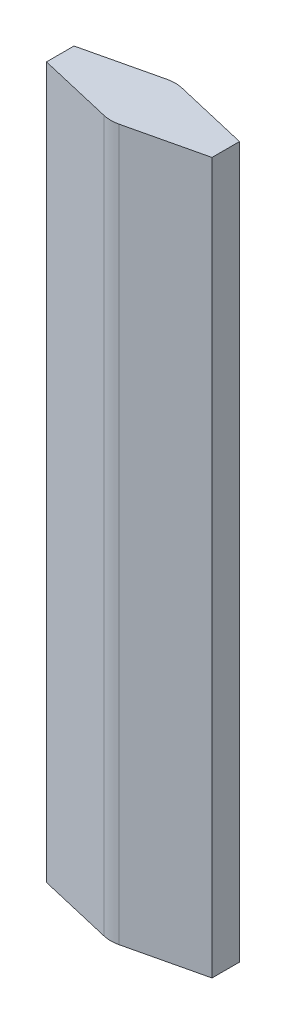
ISO-10303-21;
HEADER;
FILE_DESCRIPTION(('STEP AP214'),'2;1');
FILE_NAME('part.step','',(''),(''),'','','');
FILE_SCHEMA(('AUTOMOTIVE_DESIGN { 1 0 10303 214 1 1 1 1 }'));
ENDSEC;
DATA;
#1=APPLICATION_CONTEXT('core data for automotive mechanical design processes');
#2=APPLICATION_PROTOCOL_DEFINITION('international standard','automotive_design',2000,#1);
#3=PRODUCT_CONTEXT('',#1,'mechanical');
#4=PRODUCT('Part','Part','',(#3));
#5=PRODUCT_RELATED_PRODUCT_CATEGORY('part','',(#4));
#6=PRODUCT_DEFINITION_FORMATION('','',#4);
#7=PRODUCT_DEFINITION_CONTEXT('part definition',#1,'design');
#8=PRODUCT_DEFINITION('design','',#6,#7);
#9=PRODUCT_DEFINITION_SHAPE('','',#8);
#10=(LENGTH_UNIT() NAMED_UNIT(*) SI_UNIT(.MILLI.,.METRE.));
#11=(NAMED_UNIT(*) PLANE_ANGLE_UNIT() SI_UNIT($,.RADIAN.));
#12=(NAMED_UNIT(*) SI_UNIT($,.STERADIAN.) SOLID_ANGLE_UNIT());
#13=UNCERTAINTY_MEASURE_WITH_UNIT(LENGTH_MEASURE(1.E-05),#10,'distance_accuracy_value','');
#14=(GEOMETRIC_REPRESENTATION_CONTEXT(3) GLOBAL_UNCERTAINTY_ASSIGNED_CONTEXT((#13)) GLOBAL_UNIT_ASSIGNED_CONTEXT((#10,
#11,#12)) REPRESENTATION_CONTEXT('',''));
#15=CARTESIAN_POINT('',(0.,0.,0.));
#16=DIRECTION('',(0.,0.,1.));
#17=DIRECTION('',(1.,0.,0.));
#18=AXIS2_PLACEMENT_3D('',#15,#16,#17);
#19=CARTESIAN_POINT('',(0.,1500.,0.));
#20=DIRECTION('',(0.,-1.,0.));
#21=DIRECTION('',(0.,0.,-1.));
#22=AXIS2_PLACEMENT_3D('',#19,#20,#21);
#23=CYLINDRICAL_SURFACE('',#22,69.);
#24=CARTESIAN_POINT('',(0.,-10.,0.));
#25=DIRECTION('',(0.,1.,0.));
#26=DIRECTION('',(0.,0.,1.));
#27=AXIS2_PLACEMENT_3D('',#24,#25,#26);
#28=CIRCLE('',#27,69.);
#29=CARTESIAN_POINT('',(15.732,-10.,-67.1826181091508));
#30=VERTEX_POINT('',#29);
#31=CARTESIAN_POINT('',(-15.732,-10.,-67.1826181091508));
#32=VERTEX_POINT('',#31);
#33=EDGE_CURVE('E195',#30,#32,#28,.T.);
#34=ORIENTED_EDGE('',*,*,#33,.T.);
#35=DIRECTION('',(0.,1.,0.));
#36=VECTOR('',#35,1.);
#37=CARTESIAN_POINT('',(-15.732,1500.,-67.1826181091508));
#38=LINE('',#37,#36);
#39=CARTESIAN_POINT('',(-15.732,1510.,-67.1826181091508));
#40=VERTEX_POINT('',#39);
#41=EDGE_CURVE('E188',#40,#32,#38,.F.);
#42=ORIENTED_EDGE('',*,*,#41,.F.);
#43=CARTESIAN_POINT('',(0.,1510.,0.));
#44=DIRECTION('',(0.,1.,0.));
#45=DIRECTION('',(0.,0.,1.));
#46=AXIS2_PLACEMENT_3D('',#43,#44,#45);
#47=CIRCLE('',#46,69.);
#48=CARTESIAN_POINT('',(15.732,1510.,-67.1826181091508));
#49=VERTEX_POINT('',#48);
#50=EDGE_CURVE('E254',#49,#40,#47,.T.);
#51=ORIENTED_EDGE('',*,*,#50,.F.);
#52=DIRECTION('',(0.,-1.,0.));
#53=VECTOR('',#52,1.);
#54=CARTESIAN_POINT('',(15.732,1500.,-67.1826181091508));
#55=LINE('',#54,#53);
#56=EDGE_CURVE('E249',#49,#30,#55,.T.);
#57=ORIENTED_EDGE('',*,*,#56,.T.);
#58=EDGE_LOOP('',(#34,#42,#51,#57));
#59=FACE_BOUND('',#58,.T.);
#60=ADVANCED_FACE('F40',(#59),#23,.T.);
#61=CARTESIAN_POINT('',(-15.732,1500.,-67.1826181091508));
#62=DIRECTION('',(0.228,0.,0.973661132016679));
#63=DIRECTION('',(0.973661132016679,0.,-0.228));
#64=AXIS2_PLACEMENT_3D('',#61,#62,#63);
#65=PLANE('',#64);
#66=DIRECTION('',(-0.973661132016679,0.,0.228));
#67=VECTOR('',#66,1.);
#68=CARTESIAN_POINT('',(-15.732,-10.,-67.1826181091508));
#69=LINE('',#68,#67);
#70=CARTESIAN_POINT('',(-177.,-10.,-29.4188594554161));
#71=VERTEX_POINT('',#70);
#72=EDGE_CURVE('E182',#32,#71,#69,.T.);
#73=ORIENTED_EDGE('',*,*,#72,.T.);
#74=DIRECTION('',(0.,-1.,0.));
#75=VECTOR('',#74,1.);
#76=CARTESIAN_POINT('',(-177.,1500.,-29.4188594554161));
#77=LINE('',#76,#75);
#78=CARTESIAN_POINT('',(-177.,1510.,-29.4188594554161));
#79=VERTEX_POINT('',#78);
#80=EDGE_CURVE('E185',#79,#71,#77,.T.);
#81=ORIENTED_EDGE('',*,*,#80,.F.);
#82=DIRECTION('',(-0.973661132016679,0.,0.228));
#83=VECTOR('',#82,1.);
#84=CARTESIAN_POINT('',(-15.732,1510.,-67.1826181091508));
#85=LINE('',#84,#83);
#86=EDGE_CURVE('E216',#40,#79,#85,.T.);
#87=ORIENTED_EDGE('',*,*,#86,.F.);
#88=ORIENTED_EDGE('',*,*,#41,.T.);
#89=EDGE_LOOP('',(#73,#81,#87,#88));
#90=FACE_BOUND('',#89,.T.);
#91=ADVANCED_FACE('F184',(#90),#65,.F.);
#92=CARTESIAN_POINT('',(-177.,1500.,-21.4900228754757));
#93=DIRECTION('',(1.,0.,0.));
#94=DIRECTION('',(0.,0.,-1.));
#95=AXIS2_PLACEMENT_3D('',#92,#93,#94);
#96=PLANE('',#95);
#97=DIRECTION('',(0.,0.,1.));
#98=VECTOR('',#97,1.);
#99=CARTESIAN_POINT('',(-177.,-10.,-21.4900228754757));
#100=LINE('',#99,#98);
#101=CARTESIAN_POINT('',(-177.,-10.,29.4188594554161));
#102=VERTEX_POINT('',#101);
#103=EDGE_CURVE('E194',#71,#102,#100,.T.);
#104=ORIENTED_EDGE('',*,*,#103,.T.);
#105=DIRECTION('',(0.,-1.,0.));
#106=VECTOR('',#105,1.);
#107=CARTESIAN_POINT('',(-177.,1500.,29.4188594554161));
#108=LINE('',#107,#106);
#109=CARTESIAN_POINT('',(-177.,1510.,29.4188594554161));
#110=VERTEX_POINT('',#109);
#111=EDGE_CURVE('E203',#110,#102,#108,.T.);
#112=ORIENTED_EDGE('',*,*,#111,.F.);
#113=DIRECTION('',(0.,0.,1.));
#114=VECTOR('',#113,1.);
#115=CARTESIAN_POINT('',(-177.,1510.,-21.4900228754757));
#116=LINE('',#115,#114);
#117=EDGE_CURVE('E201',#79,#110,#116,.T.);
#118=ORIENTED_EDGE('',*,*,#117,.F.);
#119=ORIENTED_EDGE('',*,*,#80,.T.);
#120=EDGE_LOOP('',(#104,#112,#118,#119));
#121=FACE_BOUND('',#120,.T.);
#122=ADVANCED_FACE('F198',(#121),#96,.F.);
#123=CARTESIAN_POINT('',(-169.28,1500.,31.2266341956425));
#124=DIRECTION('',(0.228,0.,-0.973661132016679));
#125=DIRECTION('',(-0.973661132016679,0.,-0.228));
#126=AXIS2_PLACEMENT_3D('',#123,#124,#125);
#127=PLANE('',#126);
#128=DIRECTION('',(0.973661132016679,0.,0.228));
#129=VECTOR('',#128,1.);
#130=CARTESIAN_POINT('',(-169.28,-10.,31.2266341956425));
#131=LINE('',#130,#129);
#132=CARTESIAN_POINT('',(-15.7319998104866,-10.,67.1826181535287));
#133=VERTEX_POINT('',#132);
#134=EDGE_CURVE('E208',#102,#133,#131,.T.);
#135=ORIENTED_EDGE('',*,*,#134,.T.);
#136=DIRECTION('',(0.,-1.,0.));
#137=VECTOR('',#136,1.);
#138=CARTESIAN_POINT('',(-15.7319998104866,1500.,67.1826181535287));
#139=LINE('',#138,#137);
#140=CARTESIAN_POINT('',(-15.7319998104866,1510.,67.1826181535287));
#141=VERTEX_POINT('',#140);
#142=EDGE_CURVE('E219',#141,#133,#139,.T.);
#143=ORIENTED_EDGE('',*,*,#142,.F.);
#144=DIRECTION('',(0.973661132016679,0.,0.228));
#145=VECTOR('',#144,1.);
#146=CARTESIAN_POINT('',(-169.28,1510.,31.2266341956425));
#147=LINE('',#146,#145);
#148=EDGE_CURVE('E221',#110,#141,#147,.T.);
#149=ORIENTED_EDGE('',*,*,#148,.F.);
#150=ORIENTED_EDGE('',*,*,#111,.T.);
#151=EDGE_LOOP('',(#135,#143,#149,#150));
#152=FACE_BOUND('',#151,.T.);
#153=ADVANCED_FACE('F349',(#152),#127,.F.);
#154=CARTESIAN_POINT('',(0.,1500.,0.));
#155=DIRECTION('',(0.,-1.,0.));
#156=DIRECTION('',(0.,0.,-1.));
#157=AXIS2_PLACEMENT_3D('',#154,#155,#156);
#158=CYLINDRICAL_SURFACE('',#157,69.);
#159=CARTESIAN_POINT('',(0.,-10.,0.));
#160=DIRECTION('',(0.,1.,0.));
#161=DIRECTION('',(0.,0.,1.));
#162=AXIS2_PLACEMENT_3D('',#159,#160,#161);
#163=CIRCLE('',#162,69.);
#164=CARTESIAN_POINT('',(15.732,-10.,67.1826181091508));
#165=VERTEX_POINT('',#164);
#166=EDGE_CURVE('E212',#133,#165,#163,.T.);
#167=ORIENTED_EDGE('',*,*,#166,.T.);
#168=DIRECTION('',(0.,1.,0.));
#169=VECTOR('',#168,1.);
#170=CARTESIAN_POINT('',(15.732,1500.,67.1826181091508));
#171=LINE('',#170,#169);
#172=CARTESIAN_POINT('',(15.732,1510.,67.1826181091508));
#173=VERTEX_POINT('',#172);
#174=EDGE_CURVE('E226',#173,#165,#171,.F.);
#175=ORIENTED_EDGE('',*,*,#174,.F.);
#176=CARTESIAN_POINT('',(0.,1510.,0.));
#177=DIRECTION('',(0.,1.,0.));
#178=DIRECTION('',(0.,0.,1.));
#179=AXIS2_PLACEMENT_3D('',#176,#177,#178);
#180=CIRCLE('',#179,69.);
#181=EDGE_CURVE('E229',#141,#173,#180,.T.);
#182=ORIENTED_EDGE('',*,*,#181,.F.);
#183=ORIENTED_EDGE('',*,*,#142,.T.);
#184=EDGE_LOOP('',(#167,#175,#182,#183));
#185=FACE_BOUND('',#184,.T.);
#186=ADVANCED_FACE('F341',(#185),#158,.T.);
#187=CARTESIAN_POINT('',(15.732,1500.,67.1826181091508));
#188=DIRECTION('',(-0.228,0.,-0.973661132016679));
#189=DIRECTION('',(-0.973661132016679,0.,0.228));
#190=AXIS2_PLACEMENT_3D('',#187,#188,#189);
#191=PLANE('',#190);
#192=DIRECTION('',(0.973661132016679,0.,-0.228));
#193=VECTOR('',#192,1.);
#194=CARTESIAN_POINT('',(15.732,-10.,67.1826181091508));
#195=LINE('',#194,#193);
#196=CARTESIAN_POINT('',(177.,-10.,29.4188594554161));
#197=VERTEX_POINT('',#196);
#198=EDGE_CURVE('E154',#165,#197,#195,.T.);
#199=ORIENTED_EDGE('',*,*,#198,.T.);
#200=DIRECTION('',(0.,-1.,0.));
#201=VECTOR('',#200,1.);
#202=CARTESIAN_POINT('',(177.,1500.,29.4188594554161));
#203=LINE('',#202,#201);
#204=CARTESIAN_POINT('',(177.,1510.,29.4188594554161));
#205=VERTEX_POINT('',#204);
#206=EDGE_CURVE('E234',#205,#197,#203,.T.);
#207=ORIENTED_EDGE('',*,*,#206,.F.);
#208=DIRECTION('',(0.973661132016679,0.,-0.228));
#209=VECTOR('',#208,1.);
#210=CARTESIAN_POINT('',(15.732,1510.,67.1826181091508));
#211=LINE('',#210,#209);
#212=EDGE_CURVE('E237',#173,#205,#211,.T.);
#213=ORIENTED_EDGE('',*,*,#212,.F.);
#214=ORIENTED_EDGE('',*,*,#174,.T.);
#215=EDGE_LOOP('',(#199,#207,#213,#214));
#216=FACE_BOUND('',#215,.T.);
#217=ADVANCED_FACE('F345',(#216),#191,.F.);
#218=CARTESIAN_POINT('',(177.,1500.,21.4900228754757));
#219=DIRECTION('',(-1.,0.,0.));
#220=DIRECTION('',(0.,0.,1.));
#221=AXIS2_PLACEMENT_3D('',#218,#219,#220);
#222=PLANE('',#221);
#223=DIRECTION('',(0.,0.,-1.));
#224=VECTOR('',#223,1.);
#225=CARTESIAN_POINT('',(177.,-10.,21.4900228754757));
#226=LINE('',#225,#224);
#227=CARTESIAN_POINT('',(177.,-10.,-29.4188594554161));
#228=VERTEX_POINT('',#227);
#229=EDGE_CURVE('E146',#197,#228,#226,.T.);
#230=ORIENTED_EDGE('',*,*,#229,.T.);
#231=DIRECTION('',(0.,-1.,0.));
#232=VECTOR('',#231,1.);
#233=CARTESIAN_POINT('',(177.,1500.,-29.4188594554161));
#234=LINE('',#233,#232);
#235=CARTESIAN_POINT('',(177.,1510.,-29.4188594554161));
#236=VERTEX_POINT('',#235);
#237=EDGE_CURVE('E242',#236,#228,#234,.T.);
#238=ORIENTED_EDGE('',*,*,#237,.F.);
#239=DIRECTION('',(0.,0.,-1.));
#240=VECTOR('',#239,1.);
#241=CARTESIAN_POINT('',(177.,1510.,21.4900228754757));
#242=LINE('',#241,#240);
#243=EDGE_CURVE('E124',#205,#236,#242,.T.);
#244=ORIENTED_EDGE('',*,*,#243,.F.);
#245=ORIENTED_EDGE('',*,*,#206,.T.);
#246=EDGE_LOOP('',(#230,#238,#244,#245));
#247=FACE_BOUND('',#246,.T.);
#248=ADVANCED_FACE('F389',(#247),#222,.F.);
#249=CARTESIAN_POINT('',(169.28,1500.,-31.2266341956425));
#250=DIRECTION('',(-0.228,0.,0.973661132016679));
#251=DIRECTION('',(0.973661132016679,0.,0.228));
#252=AXIS2_PLACEMENT_3D('',#249,#250,#251);
#253=PLANE('',#252);
#254=DIRECTION('',(-0.973661132016679,0.,-0.228));
#255=VECTOR('',#254,1.);
#256=CARTESIAN_POINT('',(169.28,-10.,-31.2266341956425));
#257=LINE('',#256,#255);
#258=EDGE_CURVE('E136',#228,#30,#257,.T.);
#259=ORIENTED_EDGE('',*,*,#258,.T.);
#260=ORIENTED_EDGE('',*,*,#56,.F.);
#261=DIRECTION('',(-0.973661132016679,0.,-0.228));
#262=VECTOR('',#261,1.);
#263=CARTESIAN_POINT('',(169.28,1510.,-31.2266341956425));
#264=LINE('',#263,#262);
#265=EDGE_CURVE('E118',#236,#49,#264,.T.);
#266=ORIENTED_EDGE('',*,*,#265,.F.);
#267=ORIENTED_EDGE('',*,*,#237,.T.);
#268=EDGE_LOOP('',(#259,#260,#266,#267));
#269=FACE_BOUND('',#268,.T.);
#270=ADVANCED_FACE('F398',(#269),#253,.F.);
#271=CARTESIAN_POINT('',(0.,1510.,0.));
#272=DIRECTION('',(0.,1.,0.));
#273=DIRECTION('',(0.,0.,1.));
#274=AXIS2_PLACEMENT_3D('',#271,#272,#273);
#275=PLANE('',#274);
#276=ORIENTED_EDGE('',*,*,#50,.T.);
#277=ORIENTED_EDGE('',*,*,#86,.T.);
#278=ORIENTED_EDGE('',*,*,#117,.T.);
#279=ORIENTED_EDGE('',*,*,#148,.T.);
#280=ORIENTED_EDGE('',*,*,#181,.T.);
#281=ORIENTED_EDGE('',*,*,#212,.T.);
#282=ORIENTED_EDGE('',*,*,#243,.T.);
#283=ORIENTED_EDGE('',*,*,#265,.T.);
#284=EDGE_LOOP('',(#276,#277,#278,#279,#280,#281,#282,#283));
#285=FACE_BOUND('',#284,.T.);
#286=ADVANCED_FACE('F346',(#285),#275,.T.);
#287=CARTESIAN_POINT('',(0.,-10.,0.));
#288=DIRECTION('',(0.,1.,0.));
#289=DIRECTION('',(0.,0.,1.));
#290=AXIS2_PLACEMENT_3D('',#287,#288,#289);
#291=PLANE('',#290);
#292=ORIENTED_EDGE('',*,*,#33,.F.);
#293=ORIENTED_EDGE('',*,*,#258,.F.);
#294=ORIENTED_EDGE('',*,*,#229,.F.);
#295=ORIENTED_EDGE('',*,*,#198,.F.);
#296=ORIENTED_EDGE('',*,*,#166,.F.);
#297=ORIENTED_EDGE('',*,*,#134,.F.);
#298=ORIENTED_EDGE('',*,*,#103,.F.);
#299=ORIENTED_EDGE('',*,*,#72,.F.);
#300=EDGE_LOOP('',(#292,#293,#294,#295,#296,#297,#298,#299));
#301=FACE_BOUND('',#300,.T.);
#302=ADVANCED_FACE('F206',(#301),#291,.F.);
#303=CLOSED_SHELL('',(#60,#91,#122,#153,#186,#217,#248,#270,#286,#302));
#304=CARTESIAN_POINT('',(0.,1500.,0.));
#305=DIRECTION('',(0.,-1.,0.));
#306=DIRECTION('',(0.,0.,-1.));
#307=AXIS2_PLACEMENT_3D('',#304,#305,#306);
#308=CYLINDRICAL_SURFACE('',#307,59.);
#309=CARTESIAN_POINT('',(0.,0.,0.));
#310=DIRECTION('',(0.,1.,0.));
#311=DIRECTION('',(0.,0.,1.));
#312=AXIS2_PLACEMENT_3D('',#309,#310,#311);
#313=CIRCLE('',#312,59.);
#314=CARTESIAN_POINT('',(13.452,0.,-57.446006788984));
#315=VERTEX_POINT('',#314);
#316=CARTESIAN_POINT('',(-13.452,0.,-57.446006788984));
#317=VERTEX_POINT('',#316);
#318=EDGE_CURVE('E44',#315,#317,#313,.T.);
#319=ORIENTED_EDGE('',*,*,#318,.F.);
#320=DIRECTION('',(0.,-1.,0.));
#321=VECTOR('',#320,1.);
#322=CARTESIAN_POINT('',(13.452,1500.,-57.446006788984));
#323=LINE('',#322,#321);
#324=CARTESIAN_POINT('',(13.452,1500.,-57.446006788984));
#325=VERTEX_POINT('',#324);
#326=EDGE_CURVE('E321',#325,#315,#323,.T.);
#327=ORIENTED_EDGE('',*,*,#326,.F.);
#328=CARTESIAN_POINT('',(0.,1500.,0.));
#329=DIRECTION('',(0.,1.,0.));
#330=DIRECTION('',(0.,0.,1.));
#331=AXIS2_PLACEMENT_3D('',#328,#329,#330);
#332=CIRCLE('',#331,59.);
#333=CARTESIAN_POINT('',(-13.452,1500.,-57.446006788984));
#334=VERTEX_POINT('',#333);
#335=EDGE_CURVE('E273',#325,#334,#332,.T.);
#336=ORIENTED_EDGE('',*,*,#335,.T.);
#337=DIRECTION('',(0.,-1.,0.));
#338=VECTOR('',#337,1.);
#339=CARTESIAN_POINT('',(-13.452,1500.,-57.446006788984));
#340=LINE('',#339,#338);
#341=EDGE_CURVE('E317',#334,#317,#340,.T.);
#342=ORIENTED_EDGE('',*,*,#341,.T.);
#343=EDGE_LOOP('',(#319,#327,#336,#342));
#344=FACE_BOUND('',#343,.T.);
#345=ADVANCED_FACE('F428',(#344),#308,.F.);
#346=CARTESIAN_POINT('',(-13.452,1500.,-57.446006788984));
#347=DIRECTION('',(0.228,0.,0.973661132016679));
#348=DIRECTION('',(0.973661132016679,0.,-0.228));
#349=AXIS2_PLACEMENT_3D('',#346,#347,#348);
#350=PLANE('',#349);
#351=DIRECTION('',(-0.973661132016679,0.,0.228));
#352=VECTOR('',#351,1.);
#353=CARTESIAN_POINT('',(-13.452,0.,-57.446006788984));
#354=LINE('',#353,#352);
#355=CARTESIAN_POINT('',(-167.,0.,-21.4900228754757));
#356=VERTEX_POINT('',#355);
#357=EDGE_CURVE('E61',#317,#356,#354,.T.);
#358=ORIENTED_EDGE('',*,*,#357,.F.);
#359=ORIENTED_EDGE('',*,*,#341,.F.);
#360=DIRECTION('',(-0.973661132016679,0.,0.228));
#361=VECTOR('',#360,1.);
#362=CARTESIAN_POINT('',(-13.452,1500.,-57.446006788984));
#363=LINE('',#362,#361);
#364=CARTESIAN_POINT('',(-167.,1500.,-21.4900228754757));
#365=VERTEX_POINT('',#364);
#366=EDGE_CURVE('E108',#334,#365,#363,.T.);
#367=ORIENTED_EDGE('',*,*,#366,.T.);
#368=DIRECTION('',(0.,-1.,0.));
#369=VECTOR('',#368,1.);
#370=CARTESIAN_POINT('',(-167.,1500.,-21.4900228754757));
#371=LINE('',#370,#369);
#372=EDGE_CURVE('E311',#365,#356,#371,.T.);
#373=ORIENTED_EDGE('',*,*,#372,.T.);
#374=EDGE_LOOP('',(#358,#359,#367,#373));
#375=FACE_BOUND('',#374,.T.);
#376=ADVANCED_FACE('F432',(#375),#350,.T.);
#377=CARTESIAN_POINT('',(-167.,1500.,-21.4900228754757));
#378=DIRECTION('',(1.,0.,0.));
#379=DIRECTION('',(0.,0.,-1.));
#380=AXIS2_PLACEMENT_3D('',#377,#378,#379);
#381=PLANE('',#380);
#382=DIRECTION('',(0.,0.,1.));
#383=VECTOR('',#382,1.);
#384=CARTESIAN_POINT('',(-167.,0.,-21.4900228754757));
#385=LINE('',#384,#383);
#386=CARTESIAN_POINT('',(-167.,0.,21.4900228754757));
#387=VERTEX_POINT('',#386);
#388=EDGE_CURVE('E314',#356,#387,#385,.T.);
#389=ORIENTED_EDGE('',*,*,#388,.F.);
#390=ORIENTED_EDGE('',*,*,#372,.F.);
#391=DIRECTION('',(0.,0.,1.));
#392=VECTOR('',#391,1.);
#393=CARTESIAN_POINT('',(-167.,1500.,-21.4900228754757));
#394=LINE('',#393,#392);
#395=CARTESIAN_POINT('',(-167.,1500.,21.4900228754757));
#396=VERTEX_POINT('',#395);
#397=EDGE_CURVE('E268',#365,#396,#394,.T.);
#398=ORIENTED_EDGE('',*,*,#397,.T.);
#399=DIRECTION('',(0.,-1.,0.));
#400=VECTOR('',#399,1.);
#401=CARTESIAN_POINT('',(-167.,1500.,21.4900228754757));
#402=LINE('',#401,#400);
#403=EDGE_CURVE('E304',#396,#387,#402,.T.);
#404=ORIENTED_EDGE('',*,*,#403,.T.);
#405=EDGE_LOOP('',(#389,#390,#398,#404));
#406=FACE_BOUND('',#405,.T.);
#407=ADVANCED_FACE('F443',(#406),#381,.T.);
#408=CARTESIAN_POINT('',(-167.,1500.,21.4900228754757));
#409=DIRECTION('',(0.228,0.,-0.973661132016679));
#410=DIRECTION('',(-0.973661132016679,0.,-0.228));
#411=AXIS2_PLACEMENT_3D('',#408,#409,#410);
#412=PLANE('',#411);
#413=DIRECTION('',(0.973661132016679,0.,0.228));
#414=VECTOR('',#413,1.);
#415=CARTESIAN_POINT('',(-167.,0.,21.4900228754757));
#416=LINE('',#415,#414);
#417=CARTESIAN_POINT('',(-13.4519998379523,0.,57.4460068269304));
#418=VERTEX_POINT('',#417);
#419=EDGE_CURVE('E308',#387,#418,#416,.T.);
#420=ORIENTED_EDGE('',*,*,#419,.F.);
#421=ORIENTED_EDGE('',*,*,#403,.F.);
#422=DIRECTION('',(0.973661132016679,0.,0.228));
#423=VECTOR('',#422,1.);
#424=CARTESIAN_POINT('',(-167.,1500.,21.4900228754757));
#425=LINE('',#424,#423);
#426=CARTESIAN_POINT('',(-13.4519998379523,1500.,57.4460068269304));
#427=VERTEX_POINT('',#426);
#428=EDGE_CURVE('E265',#396,#427,#425,.T.);
#429=ORIENTED_EDGE('',*,*,#428,.T.);
#430=DIRECTION('',(0.,-1.,0.));
#431=VECTOR('',#430,1.);
#432=CARTESIAN_POINT('',(-13.4519998379523,1500.,57.4460068269304));
#433=LINE('',#432,#431);
#434=EDGE_CURVE('E297',#427,#418,#433,.T.);
#435=ORIENTED_EDGE('',*,*,#434,.T.);
#436=EDGE_LOOP('',(#420,#421,#429,#435));
#437=FACE_BOUND('',#436,.T.);
#438=ADVANCED_FACE('F452',(#437),#412,.T.);
#439=CARTESIAN_POINT('',(0.,1500.,0.));
#440=DIRECTION('',(0.,-1.,0.));
#441=DIRECTION('',(0.,0.,-1.));
#442=AXIS2_PLACEMENT_3D('',#439,#440,#441);
#443=CYLINDRICAL_SURFACE('',#442,59.);
#444=CARTESIAN_POINT('',(0.,0.,0.));
#445=DIRECTION('',(0.,1.,0.));
#446=DIRECTION('',(0.,0.,1.));
#447=AXIS2_PLACEMENT_3D('',#444,#445,#446);
#448=CIRCLE('',#447,59.);
#449=CARTESIAN_POINT('',(13.452,0.,57.446006788984));
#450=VERTEX_POINT('',#449);
#451=EDGE_CURVE('E301',#418,#450,#448,.T.);
#452=ORIENTED_EDGE('',*,*,#451,.F.);
#453=ORIENTED_EDGE('',*,*,#434,.F.);
#454=CARTESIAN_POINT('',(0.,1500.,0.));
#455=DIRECTION('',(0.,1.,0.));
#456=DIRECTION('',(0.,0.,1.));
#457=AXIS2_PLACEMENT_3D('',#454,#455,#456);
#458=CIRCLE('',#457,59.);
#459=CARTESIAN_POINT('',(13.452,1500.,57.446006788984));
#460=VERTEX_POINT('',#459);
#461=EDGE_CURVE('E262',#427,#460,#458,.T.);
#462=ORIENTED_EDGE('',*,*,#461,.T.);
#463=DIRECTION('',(0.,-1.,0.));
#464=VECTOR('',#463,1.);
#465=CARTESIAN_POINT('',(13.452,1500.,57.446006788984));
#466=LINE('',#465,#464);
#467=EDGE_CURVE('E290',#460,#450,#466,.T.);
#468=ORIENTED_EDGE('',*,*,#467,.T.);
#469=EDGE_LOOP('',(#452,#453,#462,#468));
#470=FACE_BOUND('',#469,.T.);
#471=ADVANCED_FACE('F462',(#470),#443,.F.);
#472=CARTESIAN_POINT('',(13.452,1500.,57.446006788984));
#473=DIRECTION('',(-0.228,0.,-0.973661132016679));
#474=DIRECTION('',(-0.973661132016679,0.,0.228));
#475=AXIS2_PLACEMENT_3D('',#472,#473,#474);
#476=PLANE('',#475);
#477=DIRECTION('',(0.973661132016679,0.,-0.228));
#478=VECTOR('',#477,1.);
#479=CARTESIAN_POINT('',(13.452,0.,57.446006788984));
#480=LINE('',#479,#478);
#481=CARTESIAN_POINT('',(167.,0.,21.4900228754757));
#482=VERTEX_POINT('',#481);
#483=EDGE_CURVE('E294',#450,#482,#480,.T.);
#484=ORIENTED_EDGE('',*,*,#483,.F.);
#485=ORIENTED_EDGE('',*,*,#467,.F.);
#486=DIRECTION('',(0.973661132016679,0.,-0.228));
#487=VECTOR('',#486,1.);
#488=CARTESIAN_POINT('',(13.452,1500.,57.446006788984));
#489=LINE('',#488,#487);
#490=CARTESIAN_POINT('',(167.,1500.,21.4900228754757));
#491=VERTEX_POINT('',#490);
#492=EDGE_CURVE('E259',#460,#491,#489,.T.);
#493=ORIENTED_EDGE('',*,*,#492,.T.);
#494=DIRECTION('',(0.,-1.,0.));
#495=VECTOR('',#494,1.);
#496=CARTESIAN_POINT('',(167.,1500.,21.4900228754757));
#497=LINE('',#496,#495);
#498=EDGE_CURVE('E283',#491,#482,#497,.T.);
#499=ORIENTED_EDGE('',*,*,#498,.T.);
#500=EDGE_LOOP('',(#484,#485,#493,#499));
#501=FACE_BOUND('',#500,.T.);
#502=ADVANCED_FACE('F472',(#501),#476,.T.);
#503=CARTESIAN_POINT('',(167.,1500.,21.4900228754757));
#504=DIRECTION('',(-1.,0.,0.));
#505=DIRECTION('',(0.,0.,1.));
#506=AXIS2_PLACEMENT_3D('',#503,#504,#505);
#507=PLANE('',#506);
#508=DIRECTION('',(0.,0.,-1.));
#509=VECTOR('',#508,1.);
#510=CARTESIAN_POINT('',(167.,0.,21.4900228754757));
#511=LINE('',#510,#509);
#512=CARTESIAN_POINT('',(167.,0.,-21.4900228754757));
#513=VERTEX_POINT('',#512);
#514=EDGE_CURVE('E287',#482,#513,#511,.T.);
#515=ORIENTED_EDGE('',*,*,#514,.F.);
#516=ORIENTED_EDGE('',*,*,#498,.F.);
#517=DIRECTION('',(0.,0.,-1.));
#518=VECTOR('',#517,1.);
#519=CARTESIAN_POINT('',(167.,1500.,21.4900228754757));
#520=LINE('',#519,#518);
#521=CARTESIAN_POINT('',(167.,1500.,-21.4900228754757));
#522=VERTEX_POINT('',#521);
#523=EDGE_CURVE('E52',#491,#522,#520,.T.);
#524=ORIENTED_EDGE('',*,*,#523,.T.);
#525=DIRECTION('',(0.,-1.,0.));
#526=VECTOR('',#525,1.);
#527=CARTESIAN_POINT('',(167.,1500.,-21.4900228754757));
#528=LINE('',#527,#526);
#529=EDGE_CURVE('E276',#522,#513,#528,.T.);
#530=ORIENTED_EDGE('',*,*,#529,.T.);
#531=EDGE_LOOP('',(#515,#516,#524,#530));
#532=FACE_BOUND('',#531,.T.);
#533=ADVANCED_FACE('F482',(#532),#507,.T.);
#534=CARTESIAN_POINT('',(167.,1500.,-21.4900228754757));
#535=DIRECTION('',(-0.228,0.,0.973661132016679));
#536=DIRECTION('',(0.973661132016679,0.,0.228));
#537=AXIS2_PLACEMENT_3D('',#534,#535,#536);
#538=PLANE('',#537);
#539=DIRECTION('',(-0.973661132016679,0.,-0.228));
#540=VECTOR('',#539,1.);
#541=CARTESIAN_POINT('',(167.,0.,-21.4900228754757));
#542=LINE('',#541,#540);
#543=EDGE_CURVE('E280',#513,#315,#542,.T.);
#544=ORIENTED_EDGE('',*,*,#543,.F.);
#545=ORIENTED_EDGE('',*,*,#529,.F.);
#546=DIRECTION('',(-0.973661132016679,0.,-0.228));
#547=VECTOR('',#546,1.);
#548=CARTESIAN_POINT('',(167.,1500.,-21.4900228754757));
#549=LINE('',#548,#547);
#550=EDGE_CURVE('E11',#522,#325,#549,.T.);
#551=ORIENTED_EDGE('',*,*,#550,.T.);
#552=ORIENTED_EDGE('',*,*,#326,.T.);
#553=EDGE_LOOP('',(#544,#545,#551,#552));
#554=FACE_BOUND('',#553,.T.);
#555=ADVANCED_FACE('F492',(#554),#538,.T.);
#556=CARTESIAN_POINT('',(0.,1500.,0.));
#557=DIRECTION('',(0.,1.,0.));
#558=DIRECTION('',(0.,0.,1.));
#559=AXIS2_PLACEMENT_3D('',#556,#557,#558);
#560=PLANE('',#559);
#561=ORIENTED_EDGE('',*,*,#335,.F.);
#562=ORIENTED_EDGE('',*,*,#550,.F.);
#563=ORIENTED_EDGE('',*,*,#523,.F.);
#564=ORIENTED_EDGE('',*,*,#492,.F.);
#565=ORIENTED_EDGE('',*,*,#461,.F.);
#566=ORIENTED_EDGE('',*,*,#428,.F.);
#567=ORIENTED_EDGE('',*,*,#397,.F.);
#568=ORIENTED_EDGE('',*,*,#366,.F.);
#569=EDGE_LOOP('',(#561,#562,#563,#564,#565,#566,#567,#568));
#570=FACE_BOUND('',#569,.T.);
#571=ADVANCED_FACE('F502',(#570),#560,.F.);
#572=CARTESIAN_POINT('',(0.,0.,0.));
#573=DIRECTION('',(0.,1.,0.));
#574=DIRECTION('',(0.,0.,1.));
#575=AXIS2_PLACEMENT_3D('',#572,#573,#574);
#576=PLANE('',#575);
#577=ORIENTED_EDGE('',*,*,#318,.T.);
#578=ORIENTED_EDGE('',*,*,#357,.T.);
#579=ORIENTED_EDGE('',*,*,#388,.T.);
#580=ORIENTED_EDGE('',*,*,#419,.T.);
#581=ORIENTED_EDGE('',*,*,#451,.T.);
#582=ORIENTED_EDGE('',*,*,#483,.T.);
#583=ORIENTED_EDGE('',*,*,#514,.T.);
#584=ORIENTED_EDGE('',*,*,#543,.T.);
#585=EDGE_LOOP('',(#577,#578,#579,#580,#581,#582,#583,#584));
#586=FACE_BOUND('',#585,.T.);
#587=ADVANCED_FACE('F42',(#586),#576,.T.);
#588=CLOSED_SHELL('',(#345,#376,#407,#438,#471,#502,#533,#555,#571,#587));
#589=ORIENTED_CLOSED_SHELL('',*,#588,.T.);
#590=BREP_WITH_VOIDS('B2',#303,(#589));
#591=ADVANCED_BREP_SHAPE_REPRESENTATION('',(#18,#590),#14);
#592=SHAPE_DEFINITION_REPRESENTATION(#9,#591);
ENDSEC;
END-ISO-10303-21;
